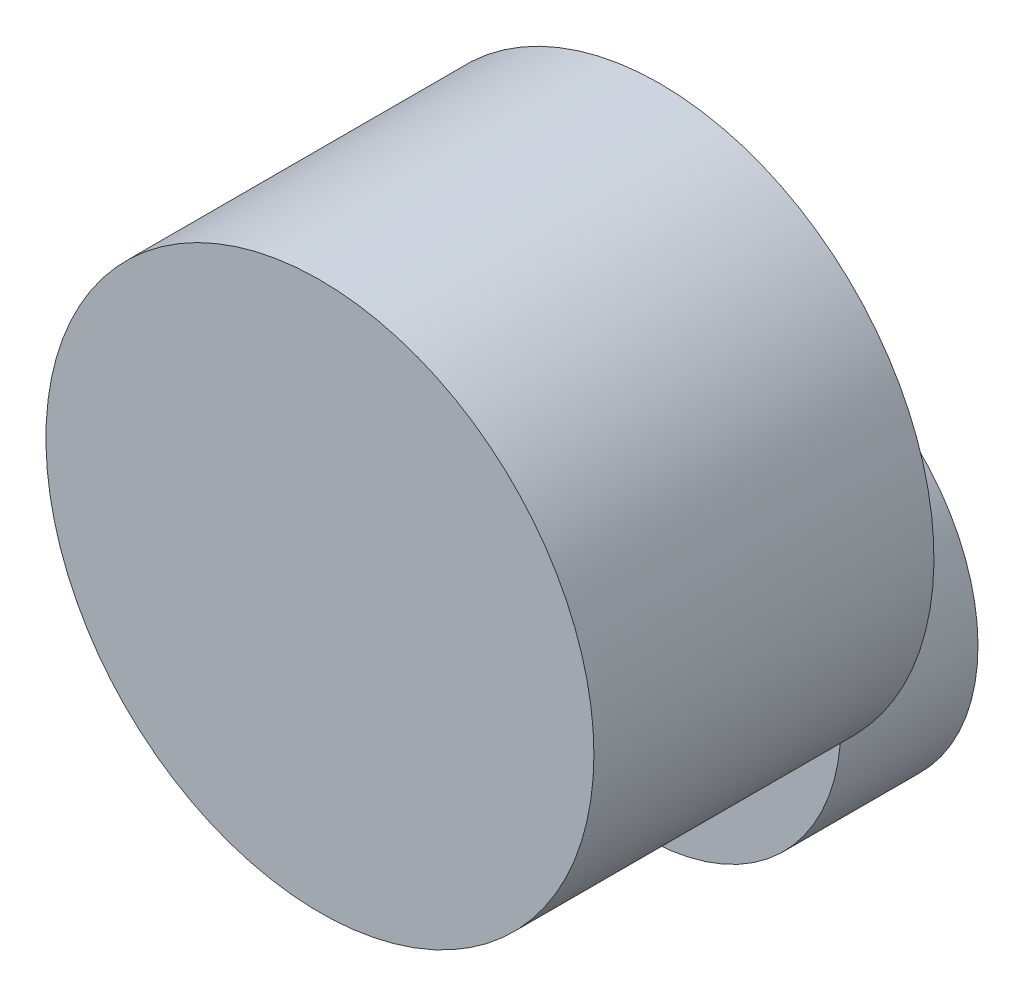
ISO-10303-21;
HEADER;
FILE_DESCRIPTION(('STEP AP214'),'2;1');
FILE_NAME('part.step','',(''),(''),'','','');
FILE_SCHEMA(('AUTOMOTIVE_DESIGN { 1 0 10303 214 1 1 1 1 }'));
ENDSEC;
DATA;
#1=APPLICATION_CONTEXT('core data for automotive mechanical design processes');
#2=APPLICATION_PROTOCOL_DEFINITION('international standard','automotive_design',2000,#1);
#3=PRODUCT_CONTEXT('',#1,'mechanical');
#4=PRODUCT('Part','Part','',(#3));
#5=PRODUCT_RELATED_PRODUCT_CATEGORY('part','',(#4));
#6=PRODUCT_DEFINITION_FORMATION('','',#4);
#7=PRODUCT_DEFINITION_CONTEXT('part definition',#1,'design');
#8=PRODUCT_DEFINITION('design','',#6,#7);
#9=PRODUCT_DEFINITION_SHAPE('','',#8);
#10=(LENGTH_UNIT() NAMED_UNIT(*) SI_UNIT(.MILLI.,.METRE.));
#11=(NAMED_UNIT(*) PLANE_ANGLE_UNIT() SI_UNIT($,.RADIAN.));
#12=(NAMED_UNIT(*) SI_UNIT($,.STERADIAN.) SOLID_ANGLE_UNIT());
#13=UNCERTAINTY_MEASURE_WITH_UNIT(LENGTH_MEASURE(1.E-05),#10,'distance_accuracy_value','');
#14=(GEOMETRIC_REPRESENTATION_CONTEXT(3) GLOBAL_UNCERTAINTY_ASSIGNED_CONTEXT((#13)) GLOBAL_UNIT_ASSIGNED_CONTEXT((#10,
#11,#12)) REPRESENTATION_CONTEXT('',''));
#15=CARTESIAN_POINT('',(0.,0.,0.));
#16=DIRECTION('',(0.,0.,1.));
#17=DIRECTION('',(1.,0.,0.));
#18=AXIS2_PLACEMENT_3D('',#15,#16,#17);
#19=CARTESIAN_POINT('',(0.,-36.,-25.));
#20=DIRECTION('',(0.,0.,-1.));
#21=DIRECTION('',(-1.,0.,0.));
#22=AXIS2_PLACEMENT_3D('',#19,#20,#21);
#23=PLANE('',#22);
#24=CARTESIAN_POINT('',(0.,-36.,-25.));
#25=DIRECTION('',(0.,0.,-1.));
#26=DIRECTION('',(-1.,0.,0.));
#27=AXIS2_PLACEMENT_3D('',#24,#25,#26);
#28=CIRCLE('',#27,40.);
#29=CARTESIAN_POINT('',(-40.,-36.,-25.));
#30=VERTEX_POINT('',#29);
#31=EDGE_CURVE('E65',#30,#30,#28,.T.);
#32=ORIENTED_EDGE('',*,*,#31,.T.);
#33=EDGE_LOOP('',(#32));
#34=FACE_BOUND('',#33,.T.);
#35=CARTESIAN_POINT('',(0.,-36.,-25.));
#36=DIRECTION('',(0.,0.,-1.));
#37=DIRECTION('',(-1.,0.,0.));
#38=AXIS2_PLACEMENT_3D('',#35,#36,#37);
#39=CIRCLE('',#38,6.35);
#40=CARTESIAN_POINT('',(-6.35,-36.,-25.));
#41=VERTEX_POINT('',#40);
#42=EDGE_CURVE('E97',#41,#41,#39,.T.);
#43=ORIENTED_EDGE('',*,*,#42,.F.);
#44=EDGE_LOOP('',(#43));
#45=FACE_BOUND('',#44,.T.);
#46=ADVANCED_FACE('F31',(#34,#45),#23,.T.);
#47=CARTESIAN_POINT('',(0.,0.,69.5));
#48=DIRECTION('',(0.,0.,-1.));
#49=DIRECTION('',(-1.,0.,0.));
#50=AXIS2_PLACEMENT_3D('',#47,#48,#49);
#51=CYLINDRICAL_SURFACE('',#50,56.);
#52=CARTESIAN_POINT('',(0.,0.,69.5));
#53=DIRECTION('',(0.,0.,1.));
#54=DIRECTION('',(1.,0.,0.));
#55=AXIS2_PLACEMENT_3D('',#52,#53,#54);
#56=CIRCLE('',#55,56.);
#57=CARTESIAN_POINT('',(56.,0.,69.5));
#58=VERTEX_POINT('',#57);
#59=EDGE_CURVE('E59',#58,#58,#56,.T.);
#60=ORIENTED_EDGE('',*,*,#59,.F.);
#61=EDGE_LOOP('',(#60));
#62=FACE_BOUND('',#61,.T.);
#63=DIRECTION('',(0.,0.,1.));
#64=VECTOR('',#63,1.);
#65=CARTESIAN_POINT('',(-39.8608691436713,-39.3333333333333,1.5));
#66=LINE('',#65,#64);
#67=CARTESIAN_POINT('',(-39.8608691436713,-39.3333333333333,3.));
#68=VERTEX_POINT('',#67);
#69=CARTESIAN_POINT('',(-39.8608691436713,-39.3333333333333,0.));
#70=VERTEX_POINT('',#69);
#71=EDGE_CURVE('E46',#68,#70,#66,.F.);
#72=ORIENTED_EDGE('',*,*,#71,.F.);
#73=CARTESIAN_POINT('',(0.,0.,3.));
#74=DIRECTION('',(0.,0.,-1.));
#75=DIRECTION('',(-1.,0.,0.));
#76=AXIS2_PLACEMENT_3D('',#73,#74,#75);
#77=CIRCLE('',#76,56.);
#78=CARTESIAN_POINT('',(39.8608691436713,-39.3333333333333,3.));
#79=VERTEX_POINT('',#78);
#80=EDGE_CURVE('E11',#79,#68,#77,.T.);
#81=ORIENTED_EDGE('',*,*,#80,.F.);
#82=DIRECTION('',(0.,0.,1.));
#83=VECTOR('',#82,1.);
#84=CARTESIAN_POINT('',(39.8608691436713,-39.3333333333333,1.5));
#85=LINE('',#84,#83);
#86=CARTESIAN_POINT('',(39.8608691436713,-39.3333333333333,0.));
#87=VERTEX_POINT('',#86);
#88=EDGE_CURVE('E61',#87,#79,#85,.T.);
#89=ORIENTED_EDGE('',*,*,#88,.F.);
#90=CARTESIAN_POINT('',(0.,0.,0.));
#91=DIRECTION('',(0.,0.,1.));
#92=DIRECTION('',(1.,0.,0.));
#93=AXIS2_PLACEMENT_3D('',#90,#91,#92);
#94=CIRCLE('',#93,56.);
#95=EDGE_CURVE('E56',#87,#70,#94,.T.);
#96=ORIENTED_EDGE('',*,*,#95,.T.);
#97=EDGE_LOOP('',(#72,#81,#89,#96));
#98=FACE_BOUND('',#97,.T.);
#99=ADVANCED_FACE('F33',(#62,#98),#51,.T.);
#100=CARTESIAN_POINT('',(0.,0.,0.));
#101=DIRECTION('',(0.,0.,1.));
#102=DIRECTION('',(1.,0.,0.));
#103=AXIS2_PLACEMENT_3D('',#100,#101,#102);
#104=PLANE('',#103);
#105=CARTESIAN_POINT('',(-49.,0.,0.));
#106=DIRECTION('',(0.,0.,-1.));
#107=DIRECTION('',(-1.,0.,0.));
#108=AXIS2_PLACEMENT_3D('',#105,#106,#107);
#109=CIRCLE('',#108,2.5);
#110=CARTESIAN_POINT('',(-51.5,0.,0.));
#111=VERTEX_POINT('',#110);
#112=EDGE_CURVE('E91',#111,#111,#109,.T.);
#113=ORIENTED_EDGE('',*,*,#112,.F.);
#114=EDGE_LOOP('',(#113));
#115=FACE_BOUND('',#114,.T.);
#116=CARTESIAN_POINT('',(0.,49.,0.));
#117=DIRECTION('',(0.,0.,-1.));
#118=DIRECTION('',(-1.,0.,0.));
#119=AXIS2_PLACEMENT_3D('',#116,#117,#118);
#120=CIRCLE('',#119,2.5);
#121=CARTESIAN_POINT('',(-2.5,49.,0.));
#122=VERTEX_POINT('',#121);
#123=EDGE_CURVE('E85',#122,#122,#120,.T.);
#124=ORIENTED_EDGE('',*,*,#123,.F.);
#125=EDGE_LOOP('',(#124));
#126=FACE_BOUND('',#125,.T.);
#127=CARTESIAN_POINT('',(49.,0.,0.));
#128=DIRECTION('',(0.,0.,-1.));
#129=DIRECTION('',(-1.,0.,0.));
#130=AXIS2_PLACEMENT_3D('',#127,#128,#129);
#131=CIRCLE('',#130,2.5);
#132=CARTESIAN_POINT('',(46.5,0.,0.));
#133=VERTEX_POINT('',#132);
#134=EDGE_CURVE('E79',#133,#133,#131,.T.);
#135=ORIENTED_EDGE('',*,*,#134,.F.);
#136=EDGE_LOOP('',(#135));
#137=FACE_BOUND('',#136,.T.);
#138=CARTESIAN_POINT('',(0.,-36.,0.));
#139=DIRECTION('',(0.,0.,1.));
#140=DIRECTION('',(1.,0.,0.));
#141=AXIS2_PLACEMENT_3D('',#138,#139,#140);
#142=CIRCLE('',#141,40.);
#143=EDGE_CURVE('E39',#70,#87,#142,.F.);
#144=ORIENTED_EDGE('',*,*,#143,.F.);
#145=ORIENTED_EDGE('',*,*,#95,.F.);
#146=EDGE_LOOP('',(#144,#145));
#147=FACE_BOUND('',#146,.T.);
#148=ADVANCED_FACE('F57',(#115,#126,#137,#147),#104,.F.);
#149=CARTESIAN_POINT('',(0.,0.,69.5));
#150=DIRECTION('',(0.,0.,1.));
#151=DIRECTION('',(1.,0.,0.));
#152=AXIS2_PLACEMENT_3D('',#149,#150,#151);
#153=PLANE('',#152);
#154=ORIENTED_EDGE('',*,*,#59,.T.);
#155=EDGE_LOOP('',(#154));
#156=FACE_BOUND('',#155,.T.);
#157=ADVANCED_FACE('F119',(#156),#153,.T.);
#158=CARTESIAN_POINT('',(0.,-36.,3.));
#159=DIRECTION('',(0.,0.,-1.));
#160=DIRECTION('',(-1.,0.,0.));
#161=AXIS2_PLACEMENT_3D('',#158,#159,#160);
#162=PLANE('',#161);
#163=CARTESIAN_POINT('',(0.,-36.,3.));
#164=DIRECTION('',(0.,0.,-1.));
#165=DIRECTION('',(-1.,0.,0.));
#166=AXIS2_PLACEMENT_3D('',#163,#164,#165);
#167=CIRCLE('',#166,40.);
#168=EDGE_CURVE('E74',#79,#68,#167,.T.);
#169=ORIENTED_EDGE('',*,*,#168,.F.);
#170=ORIENTED_EDGE('',*,*,#80,.T.);
#171=EDGE_LOOP('',(#169,#170));
#172=FACE_BOUND('',#171,.T.);
#173=ADVANCED_FACE('F112',(#172),#162,.F.);
#174=CARTESIAN_POINT('',(0.,-36.,-25.));
#175=DIRECTION('',(0.,0.,1.));
#176=DIRECTION('',(1.,0.,0.));
#177=AXIS2_PLACEMENT_3D('',#174,#175,#176);
#178=CYLINDRICAL_SURFACE('',#177,40.);
#179=ORIENTED_EDGE('',*,*,#31,.F.);
#180=EDGE_LOOP('',(#179));
#181=FACE_BOUND('',#180,.T.);
#182=ORIENTED_EDGE('',*,*,#168,.T.);
#183=ORIENTED_EDGE('',*,*,#71,.T.);
#184=ORIENTED_EDGE('',*,*,#143,.T.);
#185=ORIENTED_EDGE('',*,*,#88,.T.);
#186=EDGE_LOOP('',(#182,#183,#184,#185));
#187=FACE_BOUND('',#186,.T.);
#188=ADVANCED_FACE('F67',(#181,#187),#178,.T.);
#189=CARTESIAN_POINT('',(49.,0.,10.));
#190=DIRECTION('',(0.,0.,-1.));
#191=DIRECTION('',(-1.,0.,0.));
#192=AXIS2_PLACEMENT_3D('',#189,#190,#191);
#193=CYLINDRICAL_SURFACE('',#192,2.5);
#194=CARTESIAN_POINT('',(49.,0.,10.));
#195=DIRECTION('',(0.,0.,-1.));
#196=DIRECTION('',(-1.,0.,0.));
#197=AXIS2_PLACEMENT_3D('',#194,#195,#196);
#198=CIRCLE('',#197,2.5);
#199=CARTESIAN_POINT('',(46.5,0.,10.));
#200=VERTEX_POINT('',#199);
#201=EDGE_CURVE('E76',#200,#200,#198,.T.);
#202=ORIENTED_EDGE('',*,*,#201,.F.);
#203=EDGE_LOOP('',(#202));
#204=FACE_BOUND('',#203,.T.);
#205=ORIENTED_EDGE('',*,*,#134,.T.);
#206=EDGE_LOOP('',(#205));
#207=FACE_BOUND('',#206,.T.);
#208=ADVANCED_FACE('F116',(#204,#207),#193,.F.);
#209=CARTESIAN_POINT('',(49.,0.,10.));
#210=DIRECTION('',(0.,0.,-1.));
#211=DIRECTION('',(-1.,0.,0.));
#212=AXIS2_PLACEMENT_3D('',#209,#210,#211);
#213=PLANE('',#212);
#214=ORIENTED_EDGE('',*,*,#201,.T.);
#215=EDGE_LOOP('',(#214));
#216=FACE_BOUND('',#215,.T.);
#217=ADVANCED_FACE('F142',(#216),#213,.T.);
#218=CARTESIAN_POINT('',(0.,49.,10.));
#219=DIRECTION('',(0.,0.,-1.));
#220=DIRECTION('',(-1.,0.,0.));
#221=AXIS2_PLACEMENT_3D('',#218,#219,#220);
#222=CYLINDRICAL_SURFACE('',#221,2.5);
#223=CARTESIAN_POINT('',(0.,49.,10.));
#224=DIRECTION('',(0.,0.,-1.));
#225=DIRECTION('',(-1.,0.,0.));
#226=AXIS2_PLACEMENT_3D('',#223,#224,#225);
#227=CIRCLE('',#226,2.5);
#228=CARTESIAN_POINT('',(-2.5,49.,10.));
#229=VERTEX_POINT('',#228);
#230=EDGE_CURVE('E82',#229,#229,#227,.T.);
#231=ORIENTED_EDGE('',*,*,#230,.F.);
#232=EDGE_LOOP('',(#231));
#233=FACE_BOUND('',#232,.T.);
#234=ORIENTED_EDGE('',*,*,#123,.T.);
#235=EDGE_LOOP('',(#234));
#236=FACE_BOUND('',#235,.T.);
#237=ADVANCED_FACE('F149',(#233,#236),#222,.F.);
#238=CARTESIAN_POINT('',(0.,49.,10.));
#239=DIRECTION('',(0.,0.,-1.));
#240=DIRECTION('',(-1.,0.,0.));
#241=AXIS2_PLACEMENT_3D('',#238,#239,#240);
#242=PLANE('',#241);
#243=ORIENTED_EDGE('',*,*,#230,.T.);
#244=EDGE_LOOP('',(#243));
#245=FACE_BOUND('',#244,.T.);
#246=ADVANCED_FACE('F157',(#245),#242,.T.);
#247=CARTESIAN_POINT('',(-49.,0.,10.));
#248=DIRECTION('',(0.,0.,-1.));
#249=DIRECTION('',(-1.,0.,0.));
#250=AXIS2_PLACEMENT_3D('',#247,#248,#249);
#251=CYLINDRICAL_SURFACE('',#250,2.5);
#252=CARTESIAN_POINT('',(-49.,0.,10.));
#253=DIRECTION('',(0.,0.,-1.));
#254=DIRECTION('',(-1.,0.,0.));
#255=AXIS2_PLACEMENT_3D('',#252,#253,#254);
#256=CIRCLE('',#255,2.5);
#257=CARTESIAN_POINT('',(-51.5,0.,10.));
#258=VERTEX_POINT('',#257);
#259=EDGE_CURVE('E88',#258,#258,#256,.T.);
#260=ORIENTED_EDGE('',*,*,#259,.F.);
#261=EDGE_LOOP('',(#260));
#262=FACE_BOUND('',#261,.T.);
#263=ORIENTED_EDGE('',*,*,#112,.T.);
#264=EDGE_LOOP('',(#263));
#265=FACE_BOUND('',#264,.T.);
#266=ADVANCED_FACE('F165',(#262,#265),#251,.F.);
#267=CARTESIAN_POINT('',(-49.,0.,10.));
#268=DIRECTION('',(0.,0.,-1.));
#269=DIRECTION('',(-1.,0.,0.));
#270=AXIS2_PLACEMENT_3D('',#267,#268,#269);
#271=PLANE('',#270);
#272=ORIENTED_EDGE('',*,*,#259,.T.);
#273=EDGE_LOOP('',(#272));
#274=FACE_BOUND('',#273,.T.);
#275=ADVANCED_FACE('F173',(#274),#271,.T.);
#276=CARTESIAN_POINT('',(0.,-36.,-37.7));
#277=DIRECTION('',(0.,0.,1.));
#278=DIRECTION('',(1.,0.,0.));
#279=AXIS2_PLACEMENT_3D('',#276,#277,#278);
#280=CYLINDRICAL_SURFACE('',#279,6.35);
#281=CARTESIAN_POINT('',(0.,-36.,-37.7));
#282=DIRECTION('',(0.,0.,-1.));
#283=DIRECTION('',(-1.,0.,0.));
#284=AXIS2_PLACEMENT_3D('',#281,#282,#283);
#285=CIRCLE('',#284,6.35);
#286=CARTESIAN_POINT('',(-6.35,-36.,-37.7));
#287=VERTEX_POINT('',#286);
#288=EDGE_CURVE('E94',#287,#287,#285,.T.);
#289=ORIENTED_EDGE('',*,*,#288,.F.);
#290=EDGE_LOOP('',(#289));
#291=FACE_BOUND('',#290,.T.);
#292=ORIENTED_EDGE('',*,*,#42,.T.);
#293=EDGE_LOOP('',(#292));
#294=FACE_BOUND('',#293,.T.);
#295=ADVANCED_FACE('F101',(#291,#294),#280,.T.);
#296=CARTESIAN_POINT('',(0.,-36.,-37.7));
#297=DIRECTION('',(0.,0.,-1.));
#298=DIRECTION('',(-1.,0.,0.));
#299=AXIS2_PLACEMENT_3D('',#296,#297,#298);
#300=PLANE('',#299);
#301=ORIENTED_EDGE('',*,*,#288,.T.);
#302=EDGE_LOOP('',(#301));
#303=FACE_BOUND('',#302,.T.);
#304=ADVANCED_FACE('F188',(#303),#300,.T.);
#305=CLOSED_SHELL('',(#46,#99,#148,#157,#173,#188,#208,#217,#237,#246,#266,#275,#295,#304));
#306=MANIFOLD_SOLID_BREP('B2',#305);
#307=ADVANCED_BREP_SHAPE_REPRESENTATION('',(#18,#306),#14);
#308=SHAPE_DEFINITION_REPRESENTATION(#9,#307);
ENDSEC;
END-ISO-10303-21;
